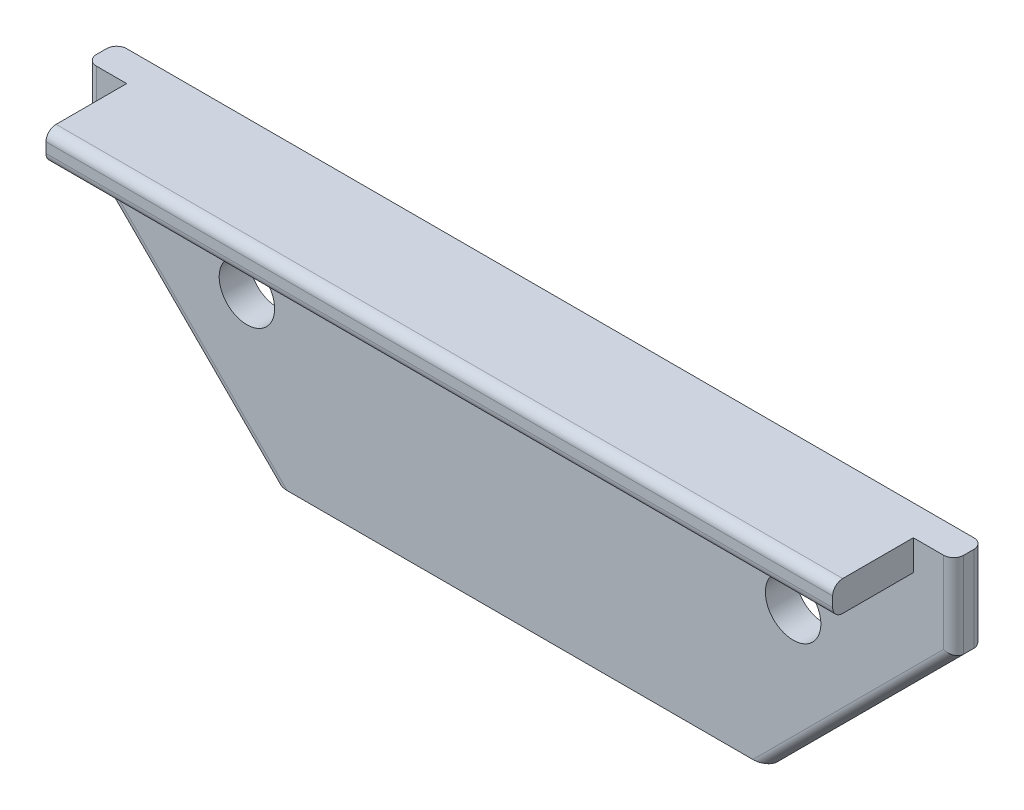
ISO-10303-21;
HEADER;
FILE_DESCRIPTION(('STEP AP214'),'2;1');
FILE_NAME('part.step','',(''),(''),'','','');
FILE_SCHEMA(('AUTOMOTIVE_DESIGN { 1 0 10303 214 1 1 1 1 }'));
ENDSEC;
DATA;
#1=APPLICATION_CONTEXT('core data for automotive mechanical design processes');
#2=APPLICATION_PROTOCOL_DEFINITION('international standard','automotive_design',2000,#1);
#3=PRODUCT_CONTEXT('',#1,'mechanical');
#4=PRODUCT('Part','Part','',(#3));
#5=PRODUCT_RELATED_PRODUCT_CATEGORY('part','',(#4));
#6=PRODUCT_DEFINITION_FORMATION('','',#4);
#7=PRODUCT_DEFINITION_CONTEXT('part definition',#1,'design');
#8=PRODUCT_DEFINITION('design','',#6,#7);
#9=PRODUCT_DEFINITION_SHAPE('','',#8);
#10=(LENGTH_UNIT() NAMED_UNIT(*) SI_UNIT(.MILLI.,.METRE.));
#11=(NAMED_UNIT(*) PLANE_ANGLE_UNIT() SI_UNIT($,.RADIAN.));
#12=(NAMED_UNIT(*) SI_UNIT($,.STERADIAN.) SOLID_ANGLE_UNIT());
#13=UNCERTAINTY_MEASURE_WITH_UNIT(LENGTH_MEASURE(1.E-05),#10,'distance_accuracy_value','');
#14=(GEOMETRIC_REPRESENTATION_CONTEXT(3) GLOBAL_UNCERTAINTY_ASSIGNED_CONTEXT((#13)) GLOBAL_UNIT_ASSIGNED_CONTEXT((#10,
#11,#12)) REPRESENTATION_CONTEXT('',''));
#15=CARTESIAN_POINT('',(0.,0.,0.));
#16=DIRECTION('',(0.,0.,1.));
#17=DIRECTION('',(1.,0.,0.));
#18=AXIS2_PLACEMENT_3D('',#15,#16,#17);
#19=CARTESIAN_POINT('',(0.,0.,-7.9375));
#20=DIRECTION('',(0.,0.,-1.));
#21=DIRECTION('',(-1.,0.,0.));
#22=AXIS2_PLACEMENT_3D('',#19,#20,#21);
#23=PLANE('',#22);
#24=CARTESIAN_POINT('',(85.9789999123034,4.76249999514226,-7.9375));
#25=DIRECTION('',(0.,0.,-1.));
#26=DIRECTION('',(-1.,0.,0.));
#27=AXIS2_PLACEMENT_3D('',#24,#25,#26);
#28=CIRCLE('',#27,8.73124999109411);
#29=CARTESIAN_POINT('',(77.2477499212093,4.76249999514226,-7.9375));
#30=VERTEX_POINT('',#29);
#31=EDGE_CURVE('E227',#30,#30,#28,.T.);
#32=ORIENTED_EDGE('',*,*,#31,.T.);
#33=EDGE_LOOP('',(#32));
#34=FACE_BOUND('',#33,.T.);
#35=CARTESIAN_POINT('',(-85.9789999123005,4.76249999514226,-7.9375));
#36=DIRECTION('',(0.,0.,-1.));
#37=DIRECTION('',(-1.,0.,0.));
#38=AXIS2_PLACEMENT_3D('',#35,#36,#37);
#39=CIRCLE('',#38,8.73124999109411);
#40=CARTESIAN_POINT('',(-94.7102499033946,4.76249999514226,-7.9375));
#41=VERTEX_POINT('',#40);
#42=EDGE_CURVE('E192',#41,#41,#39,.T.);
#43=ORIENTED_EDGE('',*,*,#42,.T.);
#44=EDGE_LOOP('',(#43));
#45=FACE_BOUND('',#44,.T.);
#46=DIRECTION('',(-1.,0.,0.));
#47=VECTOR('',#46,1.);
#48=CARTESIAN_POINT('',(136.524999860745,42.8624999562803,-7.9375));
#49=LINE('',#48,#47);
#50=CARTESIAN_POINT('',(-123.824999873699,42.8624999562803,-7.9375));
#51=VERTEX_POINT('',#50);
#52=CARTESIAN_POINT('',(-133.349999860745,42.8624999562803,-7.9375));
#53=VERTEX_POINT('',#52);
#54=EDGE_CURVE('E183',#51,#53,#49,.T.);
#55=ORIENTED_EDGE('',*,*,#54,.T.);
#56=DIRECTION('',(0.,-1.,0.));
#57=VECTOR('',#56,1.);
#58=CARTESIAN_POINT('',(-133.349999860745,15.8749999838082,-7.9375));
#59=LINE('',#58,#57);
#60=CARTESIAN_POINT('',(-133.349999860745,17.1901280443428,-7.9375));
#61=VERTEX_POINT('',#60);
#62=EDGE_CURVE('E270',#53,#61,#59,.T.);
#63=ORIENTED_EDGE('',*,*,#62,.T.);
#64=DIRECTION('',(0.707106781186556,-0.707106781186539,0.));
#65=VECTOR('',#64,1.);
#66=CARTESIAN_POINT('',(-75.5424358903875,-40.617435926013,-7.9375));
#67=LINE('',#66,#65);
#68=CARTESIAN_POINT('',(-73.2973718601201,-42.8624999562803,-7.9375));
#69=VERTEX_POINT('',#68);
#70=EDGE_CURVE('E268',#61,#69,#67,.T.);
#71=ORIENTED_EDGE('',*,*,#70,.T.);
#72=DIRECTION('',(1.,0.,0.));
#73=VECTOR('',#72,1.);
#74=CARTESIAN_POINT('',(-77.7874999206547,-42.8624999562803,-7.9375));
#75=LINE('',#74,#73);
#76=CARTESIAN_POINT('',(73.2973718601231,-42.8624999562803,-7.9375));
#77=VERTEX_POINT('',#76);
#78=EDGE_CURVE('E182',#69,#77,#75,.T.);
#79=ORIENTED_EDGE('',*,*,#78,.T.);
#80=DIRECTION('',(0.707106781186539,0.707106781186556,0.));
#81=VECTOR('',#80,1.);
#82=CARTESIAN_POINT('',(134.279935830477,18.1200640140755,-7.9375));
#83=LINE('',#82,#81);
#84=CARTESIAN_POINT('',(133.349999860745,17.1901280443428,-7.9375));
#85=VERTEX_POINT('',#84);
#86=EDGE_CURVE('E266',#77,#85,#83,.T.);
#87=ORIENTED_EDGE('',*,*,#86,.T.);
#88=DIRECTION('',(0.,1.,0.));
#89=VECTOR('',#88,1.);
#90=CARTESIAN_POINT('',(133.349999860745,42.8624999562803,-7.9375));
#91=LINE('',#90,#89);
#92=CARTESIAN_POINT('',(133.349999860745,42.8624999562803,-7.9375));
#93=VERTEX_POINT('',#92);
#94=EDGE_CURVE('E181',#85,#93,#91,.T.);
#95=ORIENTED_EDGE('',*,*,#94,.T.);
#96=CARTESIAN_POINT('',(123.824999873699,42.8624999562803,-7.9375));
#97=VERTEX_POINT('',#96);
#98=EDGE_CURVE('E163',#93,#97,#49,.T.);
#99=ORIENTED_EDGE('',*,*,#98,.T.);
#100=DIRECTION('',(0.,1.,0.));
#101=VECTOR('',#100,1.);
#102=CARTESIAN_POINT('',(123.824999873699,42.8624999562803,-7.9375));
#103=LINE('',#102,#101);
#104=CARTESIAN_POINT('',(123.824999873699,33.3374999659958,-7.9375));
#105=VERTEX_POINT('',#104);
#106=EDGE_CURVE('E177',#105,#97,#103,.T.);
#107=ORIENTED_EDGE('',*,*,#106,.F.);
#108=DIRECTION('',(1.,0.,0.));
#109=VECTOR('',#108,1.);
#110=CARTESIAN_POINT('',(123.824999873699,33.3374999659958,-7.9375));
#111=LINE('',#110,#109);
#112=CARTESIAN_POINT('',(-123.824999873699,33.3374999659958,-7.9375));
#113=VERTEX_POINT('',#112);
#114=EDGE_CURVE('E187',#113,#105,#111,.T.);
#115=ORIENTED_EDGE('',*,*,#114,.F.);
#116=DIRECTION('',(0.,-1.,0.));
#117=VECTOR('',#116,1.);
#118=CARTESIAN_POINT('',(-123.824999873699,33.3374999659958,-7.9375));
#119=LINE('',#118,#117);
#120=EDGE_CURVE('E186',#51,#113,#119,.T.);
#121=ORIENTED_EDGE('',*,*,#120,.F.);
#122=EDGE_LOOP('',(#55,#63,#71,#79,#87,#95,#99,#107,#115,#121));
#123=FACE_BOUND('',#122,.T.);
#124=ADVANCED_FACE('F34',(#34,#45,#123),#23,.F.);
#125=CARTESIAN_POINT('',(77.7874999206576,-42.8624999562803,-17.4625));
#126=DIRECTION('',(0.707106781186556,-0.707106781186539,0.));
#127=DIRECTION('',(0.707106781186539,0.707106781186556,0.));
#128=AXIS2_PLACEMENT_3D('',#125,#126,#127);
#129=PLANE('',#128);
#130=DIRECTION('',(0.,0.,1.));
#131=VECTOR('',#130,1.);
#132=CARTESIAN_POINT('',(77.7874999206576,-42.8624999562803,-17.4625));
#133=LINE('',#132,#131);
#134=CARTESIAN_POINT('',(77.7874999206576,-42.8624999562803,-14.2875));
#135=VERTEX_POINT('',#134);
#136=CARTESIAN_POINT('',(77.7874999206576,-42.8624999562803,-11.1125));
#137=VERTEX_POINT('',#136);
#138=EDGE_CURVE('E209',#135,#137,#133,.T.);
#139=ORIENTED_EDGE('',*,*,#138,.F.);
#140=DIRECTION('',(0.707106781186539,0.707106781186556,0.));
#141=VECTOR('',#140,1.);
#142=CARTESIAN_POINT('',(77.7874999206576,-42.8624999562803,-14.2875));
#143=LINE('',#142,#141);
#144=CARTESIAN_POINT('',(136.524999860745,15.8749999838083,-14.2875));
#145=VERTEX_POINT('',#144);
#146=EDGE_CURVE('E280',#135,#145,#143,.T.);
#147=ORIENTED_EDGE('',*,*,#146,.T.);
#148=DIRECTION('',(0.,0.,1.));
#149=VECTOR('',#148,1.);
#150=CARTESIAN_POINT('',(136.524999860745,15.8749999838083,-17.4625));
#151=LINE('',#150,#149);
#152=CARTESIAN_POINT('',(136.524999860745,15.8749999838083,-11.1125));
#153=VERTEX_POINT('',#152);
#154=EDGE_CURVE('E205',#145,#153,#151,.T.);
#155=ORIENTED_EDGE('',*,*,#154,.T.);
#156=DIRECTION('',(0.707106781186539,0.707106781186556,0.));
#157=VECTOR('',#156,1.);
#158=CARTESIAN_POINT('',(77.7874999206576,-42.8624999562803,-11.1125));
#159=LINE('',#158,#157);
#160=EDGE_CURVE('E278',#153,#137,#159,.F.);
#161=ORIENTED_EDGE('',*,*,#160,.T.);
#162=EDGE_LOOP('',(#139,#147,#155,#161));
#163=FACE_BOUND('',#162,.T.);
#164=ADVANCED_FACE('F391',(#163),#129,.T.);
#165=CARTESIAN_POINT('',(-77.7874999206547,-42.8624999562803,-17.4625));
#166=DIRECTION('',(0.,-1.,0.));
#167=DIRECTION('',(0.,0.,-1.));
#168=AXIS2_PLACEMENT_3D('',#165,#166,#167);
#169=PLANE('',#168);
#170=DIRECTION('',(0.,0.,1.));
#171=VECTOR('',#170,1.);
#172=CARTESIAN_POINT('',(-77.7874999206547,-42.8624999562803,-17.4625));
#173=LINE('',#172,#171);
#174=CARTESIAN_POINT('',(-77.7874999206547,-42.8624999562803,-14.2875));
#175=VERTEX_POINT('',#174);
#176=CARTESIAN_POINT('',(-77.7874999206547,-42.8624999562803,-11.1125));
#177=VERTEX_POINT('',#176);
#178=EDGE_CURVE('E213',#175,#177,#173,.T.);
#179=ORIENTED_EDGE('',*,*,#178,.F.);
#180=CARTESIAN_POINT('',(-73.2973718601201,-42.8624999562803,-14.2875));
#181=DIRECTION('',(0.,-1.,0.));
#182=DIRECTION('',(1.,0.,0.));
#183=AXIS2_PLACEMENT_3D('',#180,#181,#182);
#184=ELLIPSE('',#183,4.49012806053463,3.175);
#185=CARTESIAN_POINT('',(-73.2973718601201,-42.8624999562803,-17.4625));
#186=VERTEX_POINT('',#185);
#187=EDGE_CURVE('E242',#175,#186,#184,.T.);
#188=ORIENTED_EDGE('',*,*,#187,.T.);
#189=DIRECTION('',(1.,0.,0.));
#190=VECTOR('',#189,1.);
#191=CARTESIAN_POINT('',(-77.7874999206547,-42.8624999562803,-17.4625));
#192=LINE('',#191,#190);
#193=CARTESIAN_POINT('',(73.2973718601231,-42.8624999562803,-17.4625));
#194=VERTEX_POINT('',#193);
#195=EDGE_CURVE('E203',#186,#194,#192,.T.);
#196=ORIENTED_EDGE('',*,*,#195,.T.);
#197=CARTESIAN_POINT('',(73.2973718601231,-42.8624999562803,-14.2875));
#198=DIRECTION('',(0.,-1.,0.));
#199=DIRECTION('',(1.,0.,0.));
#200=AXIS2_PLACEMENT_3D('',#197,#198,#199);
#201=ELLIPSE('',#200,4.49012806053452,3.175);
#202=EDGE_CURVE('E238',#194,#135,#201,.T.);
#203=ORIENTED_EDGE('',*,*,#202,.T.);
#204=ORIENTED_EDGE('',*,*,#138,.T.);
#205=CARTESIAN_POINT('',(73.2973718601231,-42.8624999562803,-11.1125));
#206=DIRECTION('',(0.,-1.,0.));
#207=DIRECTION('',(-1.,0.,0.));
#208=AXIS2_PLACEMENT_3D('',#205,#206,#207);
#209=ELLIPSE('',#208,4.49012806053452,3.175);
#210=EDGE_CURVE('E236',#137,#77,#209,.T.);
#211=ORIENTED_EDGE('',*,*,#210,.T.);
#212=ORIENTED_EDGE('',*,*,#78,.F.);
#213=CARTESIAN_POINT('',(-73.2973718601201,-42.8624999562803,-11.1125));
#214=DIRECTION('',(0.,-1.,0.));
#215=DIRECTION('',(-1.,0.,0.));
#216=AXIS2_PLACEMENT_3D('',#213,#214,#215);
#217=ELLIPSE('',#216,4.49012806053463,3.175);
#218=EDGE_CURVE('E240',#69,#177,#217,.T.);
#219=ORIENTED_EDGE('',*,*,#218,.T.);
#220=EDGE_LOOP('',(#179,#188,#196,#203,#204,#211,#212,#219));
#221=FACE_BOUND('',#220,.T.);
#222=ADVANCED_FACE('F318',(#221),#169,.T.);
#223=CARTESIAN_POINT('',(-136.524999860745,15.8749999838082,-17.4625));
#224=DIRECTION('',(-0.707106781186539,-0.707106781186556,0.));
#225=DIRECTION('',(0.707106781186556,-0.707106781186539,0.));
#226=AXIS2_PLACEMENT_3D('',#223,#224,#225);
#227=PLANE('',#226);
#228=DIRECTION('',(0.,0.,1.));
#229=VECTOR('',#228,1.);
#230=CARTESIAN_POINT('',(-136.524999860745,15.8749999838082,-17.4625));
#231=LINE('',#230,#229);
#232=CARTESIAN_POINT('',(-136.524999860745,15.8749999838082,-14.2875));
#233=VERTEX_POINT('',#232);
#234=CARTESIAN_POINT('',(-136.524999860745,15.8749999838082,-11.1125));
#235=VERTEX_POINT('',#234);
#236=EDGE_CURVE('E216',#233,#235,#231,.T.);
#237=ORIENTED_EDGE('',*,*,#236,.F.);
#238=DIRECTION('',(0.707106781186556,-0.707106781186539,0.));
#239=VECTOR('',#238,1.);
#240=CARTESIAN_POINT('',(-136.524999860745,15.8749999838082,-14.2875));
#241=LINE('',#240,#239);
#242=EDGE_CURVE('E233',#233,#175,#241,.T.);
#243=ORIENTED_EDGE('',*,*,#242,.T.);
#244=ORIENTED_EDGE('',*,*,#178,.T.);
#245=DIRECTION('',(0.707106781186556,-0.707106781186539,0.));
#246=VECTOR('',#245,1.);
#247=CARTESIAN_POINT('',(-136.524999860745,15.8749999838082,-11.1125));
#248=LINE('',#247,#246);
#249=EDGE_CURVE('E212',#177,#235,#248,.F.);
#250=ORIENTED_EDGE('',*,*,#249,.T.);
#251=EDGE_LOOP('',(#237,#243,#244,#250));
#252=FACE_BOUND('',#251,.T.);
#253=ADVANCED_FACE('F325',(#252),#227,.T.);
#254=CARTESIAN_POINT('',(-136.524999860745,42.8624999562803,-17.4625));
#255=DIRECTION('',(-1.,0.,0.));
#256=DIRECTION('',(0.,0.,1.));
#257=AXIS2_PLACEMENT_3D('',#254,#255,#256);
#258=PLANE('',#257);
#259=DIRECTION('',(0.,0.,1.));
#260=VECTOR('',#259,1.);
#261=CARTESIAN_POINT('',(-136.524999860745,42.8624999562803,-17.4625));
#262=LINE('',#261,#260);
#263=CARTESIAN_POINT('',(-136.524999860745,42.8624999562803,-14.2875));
#264=VERTEX_POINT('',#263);
#265=CARTESIAN_POINT('',(-136.524999860745,42.8624999562803,-11.1125));
#266=VERTEX_POINT('',#265);
#267=EDGE_CURVE('E219',#264,#266,#262,.T.);
#268=ORIENTED_EDGE('',*,*,#267,.F.);
#269=DIRECTION('',(0.,-1.,0.));
#270=VECTOR('',#269,1.);
#271=CARTESIAN_POINT('',(-136.524999860745,42.8624999562803,-14.2875));
#272=LINE('',#271,#270);
#273=EDGE_CURVE('E254',#264,#233,#272,.T.);
#274=ORIENTED_EDGE('',*,*,#273,.T.);
#275=ORIENTED_EDGE('',*,*,#236,.T.);
#276=DIRECTION('',(0.,-1.,0.));
#277=VECTOR('',#276,1.);
#278=CARTESIAN_POINT('',(-136.524999860745,42.8624999562803,-11.1125));
#279=LINE('',#278,#277);
#280=EDGE_CURVE('E252',#235,#266,#279,.F.);
#281=ORIENTED_EDGE('',*,*,#280,.T.);
#282=EDGE_LOOP('',(#268,#274,#275,#281));
#283=FACE_BOUND('',#282,.T.);
#284=ADVANCED_FACE('F330',(#283),#258,.T.);
#285=CARTESIAN_POINT('',(136.524999860745,42.8624999562803,-17.4625));
#286=DIRECTION('',(0.,1.,0.));
#287=DIRECTION('',(0.,0.,1.));
#288=AXIS2_PLACEMENT_3D('',#285,#286,#287);
#289=PLANE('',#288);
#290=DIRECTION('',(-1.,0.,0.));
#291=VECTOR('',#290,1.);
#292=CARTESIAN_POINT('',(136.524999860745,42.8624999562803,-17.4625));
#293=LINE('',#292,#291);
#294=CARTESIAN_POINT('',(133.349999860745,42.8624999562803,-17.4625));
#295=VERTEX_POINT('',#294);
#296=CARTESIAN_POINT('',(-133.349999860745,42.8624999562803,-17.4625));
#297=VERTEX_POINT('',#296);
#298=EDGE_CURVE('E201',#295,#297,#293,.T.);
#299=ORIENTED_EDGE('',*,*,#298,.T.);
#300=CARTESIAN_POINT('',(-133.349999860745,42.8624999562803,-14.2875));
#301=DIRECTION('',(0.,1.,0.));
#302=DIRECTION('',(0.,0.,1.));
#303=AXIS2_PLACEMENT_3D('',#300,#301,#302);
#304=CIRCLE('',#303,3.175);
#305=EDGE_CURVE('E263',#297,#264,#304,.T.);
#306=ORIENTED_EDGE('',*,*,#305,.T.);
#307=ORIENTED_EDGE('',*,*,#267,.T.);
#308=CARTESIAN_POINT('',(-133.349999860745,42.8624999562803,-11.1125));
#309=DIRECTION('',(0.,1.,0.));
#310=DIRECTION('',(0.,0.,1.));
#311=AXIS2_PLACEMENT_3D('',#308,#309,#310);
#312=CIRCLE('',#311,3.175);
#313=EDGE_CURVE('E261',#266,#53,#312,.T.);
#314=ORIENTED_EDGE('',*,*,#313,.T.);
#315=ORIENTED_EDGE('',*,*,#54,.F.);
#316=DIRECTION('',(0.,0.,-1.));
#317=VECTOR('',#316,1.);
#318=CARTESIAN_POINT('',(-123.824999873699,42.8624999562803,17.4625));
#319=LINE('',#318,#317);
#320=CARTESIAN_POINT('',(-123.824999873699,42.8624999562803,14.2875));
#321=VERTEX_POINT('',#320);
#322=EDGE_CURVE('E171',#321,#51,#319,.T.);
#323=ORIENTED_EDGE('',*,*,#322,.F.);
#324=DIRECTION('',(-1.,0.,0.));
#325=VECTOR('',#324,1.);
#326=CARTESIAN_POINT('',(123.824999873699,42.8624999562803,14.2875));
#327=LINE('',#326,#325);
#328=CARTESIAN_POINT('',(123.824999873699,42.8624999562803,14.2875));
#329=VERTEX_POINT('',#328);
#330=EDGE_CURVE('E167',#321,#329,#327,.F.);
#331=ORIENTED_EDGE('',*,*,#330,.T.);
#332=DIRECTION('',(0.,0.,-1.));
#333=VECTOR('',#332,1.);
#334=CARTESIAN_POINT('',(123.824999873699,42.8624999562803,17.4625));
#335=LINE('',#334,#333);
#336=EDGE_CURVE('E159',#329,#97,#335,.T.);
#337=ORIENTED_EDGE('',*,*,#336,.T.);
#338=ORIENTED_EDGE('',*,*,#98,.F.);
#339=CARTESIAN_POINT('',(133.349999860745,42.8624999562803,-11.1125));
#340=DIRECTION('',(0.,1.,0.));
#341=DIRECTION('',(0.,0.,1.));
#342=AXIS2_PLACEMENT_3D('',#339,#340,#341);
#343=CIRCLE('',#342,3.175);
#344=CARTESIAN_POINT('',(136.524999860745,42.8624999562803,-11.1125));
#345=VERTEX_POINT('',#344);
#346=EDGE_CURVE('E256',#93,#345,#343,.T.);
#347=ORIENTED_EDGE('',*,*,#346,.T.);
#348=DIRECTION('',(0.,0.,1.));
#349=VECTOR('',#348,1.);
#350=CARTESIAN_POINT('',(136.524999860745,42.8624999562803,-17.4625));
#351=LINE('',#350,#349);
#352=CARTESIAN_POINT('',(136.524999860745,42.8624999562803,-14.2875));
#353=VERTEX_POINT('',#352);
#354=EDGE_CURVE('E222',#353,#345,#351,.T.);
#355=ORIENTED_EDGE('',*,*,#354,.F.);
#356=CARTESIAN_POINT('',(133.349999860745,42.8624999562803,-14.2875));
#357=DIRECTION('',(0.,1.,0.));
#358=DIRECTION('',(0.,0.,1.));
#359=AXIS2_PLACEMENT_3D('',#356,#357,#358);
#360=CIRCLE('',#359,3.175);
#361=EDGE_CURVE('E259',#353,#295,#360,.T.);
#362=ORIENTED_EDGE('',*,*,#361,.T.);
#363=EDGE_LOOP('',(#299,#306,#307,#314,#315,#323,#331,#337,#338,#347,#355,#362));
#364=FACE_BOUND('',#363,.T.);
#365=ADVANCED_FACE('F162',(#364),#289,.T.);
#366=CARTESIAN_POINT('',(136.524999860745,15.8749999838083,-17.4625));
#367=DIRECTION('',(1.,0.,0.));
#368=DIRECTION('',(0.,0.,-1.));
#369=AXIS2_PLACEMENT_3D('',#366,#367,#368);
#370=PLANE('',#369);
#371=ORIENTED_EDGE('',*,*,#154,.F.);
#372=DIRECTION('',(0.,1.,0.));
#373=VECTOR('',#372,1.);
#374=CARTESIAN_POINT('',(136.524999860745,15.8749999838083,-14.2875));
#375=LINE('',#374,#373);
#376=EDGE_CURVE('E275',#145,#353,#375,.T.);
#377=ORIENTED_EDGE('',*,*,#376,.T.);
#378=ORIENTED_EDGE('',*,*,#354,.T.);
#379=DIRECTION('',(0.,1.,0.));
#380=VECTOR('',#379,1.);
#381=CARTESIAN_POINT('',(136.524999860745,15.8749999838083,-11.1125));
#382=LINE('',#381,#380);
#383=EDGE_CURVE('E273',#345,#153,#382,.F.);
#384=ORIENTED_EDGE('',*,*,#383,.T.);
#385=EDGE_LOOP('',(#371,#377,#378,#384));
#386=FACE_BOUND('',#385,.T.);
#387=ADVANCED_FACE('F366',(#386),#370,.T.);
#388=CARTESIAN_POINT('',(0.,0.,-17.4625));
#389=DIRECTION('',(0.,0.,-1.));
#390=DIRECTION('',(-1.,0.,0.));
#391=AXIS2_PLACEMENT_3D('',#388,#389,#390);
#392=PLANE('',#391);
#393=CARTESIAN_POINT('',(85.9789999123034,4.76249999514226,-17.4625));
#394=DIRECTION('',(0.,0.,-1.));
#395=DIRECTION('',(-1.,0.,0.));
#396=AXIS2_PLACEMENT_3D('',#393,#394,#395);
#397=CIRCLE('',#396,8.73124999109411);
#398=CARTESIAN_POINT('',(77.2477499212093,4.76249999514226,-17.4625));
#399=VERTEX_POINT('',#398);
#400=EDGE_CURVE('E231',#399,#399,#397,.T.);
#401=ORIENTED_EDGE('',*,*,#400,.F.);
#402=EDGE_LOOP('',(#401));
#403=FACE_BOUND('',#402,.T.);
#404=CARTESIAN_POINT('',(-85.9789999123005,4.76249999514226,-17.4625));
#405=DIRECTION('',(0.,0.,-1.));
#406=DIRECTION('',(-1.,0.,0.));
#407=AXIS2_PLACEMENT_3D('',#404,#405,#406);
#408=CIRCLE('',#407,8.73124999109411);
#409=CARTESIAN_POINT('',(-94.7102499033946,4.76249999514226,-17.4625));
#410=VERTEX_POINT('',#409);
#411=EDGE_CURVE('E230',#410,#410,#408,.T.);
#412=ORIENTED_EDGE('',*,*,#411,.F.);
#413=EDGE_LOOP('',(#412));
#414=FACE_BOUND('',#413,.T.);
#415=ORIENTED_EDGE('',*,*,#195,.F.);
#416=DIRECTION('',(0.707106781186556,-0.707106781186539,0.));
#417=VECTOR('',#416,1.);
#418=CARTESIAN_POINT('',(-58.0799359081993,-58.0799359082007,-17.4625));
#419=LINE('',#418,#417);
#420=CARTESIAN_POINT('',(-133.349999860745,17.1901280443428,-17.4625));
#421=VERTEX_POINT('',#420);
#422=EDGE_CURVE('E250',#186,#421,#419,.F.);
#423=ORIENTED_EDGE('',*,*,#422,.T.);
#424=DIRECTION('',(0.,-1.,0.));
#425=VECTOR('',#424,1.);
#426=CARTESIAN_POINT('',(-133.349999860745,0.,-17.4625));
#427=LINE('',#426,#425);
#428=EDGE_CURVE('E248',#421,#297,#427,.F.);
#429=ORIENTED_EDGE('',*,*,#428,.T.);
#430=ORIENTED_EDGE('',*,*,#298,.F.);
#431=DIRECTION('',(0.,1.,0.));
#432=VECTOR('',#431,1.);
#433=CARTESIAN_POINT('',(133.349999860745,0.,-17.4625));
#434=LINE('',#433,#432);
#435=CARTESIAN_POINT('',(133.349999860745,17.1901280443428,-17.4625));
#436=VERTEX_POINT('',#435);
#437=EDGE_CURVE('E246',#295,#436,#434,.F.);
#438=ORIENTED_EDGE('',*,*,#437,.T.);
#439=DIRECTION('',(0.707106781186539,0.707106781186556,0.));
#440=VECTOR('',#439,1.);
#441=CARTESIAN_POINT('',(58.0799359082026,-58.0799359082012,-17.4625));
#442=LINE('',#441,#440);
#443=EDGE_CURVE('E244',#436,#194,#442,.F.);
#444=ORIENTED_EDGE('',*,*,#443,.T.);
#445=EDGE_LOOP('',(#415,#423,#429,#430,#438,#444));
#446=FACE_BOUND('',#445,.T.);
#447=ADVANCED_FACE('F362',(#403,#414,#446),#392,.T.);
#448=CARTESIAN_POINT('',(123.824999873699,33.3374999659958,17.4625));
#449=DIRECTION('',(0.,1.,0.));
#450=DIRECTION('',(0.,0.,1.));
#451=AXIS2_PLACEMENT_3D('',#448,#449,#450);
#452=PLANE('',#451);
#453=DIRECTION('',(0.,0.,-1.));
#454=VECTOR('',#453,1.);
#455=CARTESIAN_POINT('',(123.824999873699,33.3374999659958,17.4625));
#456=LINE('',#455,#454);
#457=CARTESIAN_POINT('',(123.824999873699,33.3374999659958,14.2875));
#458=VERTEX_POINT('',#457);
#459=EDGE_CURVE('E170',#458,#105,#456,.T.);
#460=ORIENTED_EDGE('',*,*,#459,.F.);
#461=DIRECTION('',(1.,0.,0.));
#462=VECTOR('',#461,1.);
#463=CARTESIAN_POINT('',(123.824999873699,33.3374999659958,14.2875));
#464=LINE('',#463,#462);
#465=CARTESIAN_POINT('',(-123.824999873699,33.3374999659958,14.2875));
#466=VERTEX_POINT('',#465);
#467=EDGE_CURVE('E11',#458,#466,#464,.F.);
#468=ORIENTED_EDGE('',*,*,#467,.T.);
#469=DIRECTION('',(0.,0.,-1.));
#470=VECTOR('',#469,1.);
#471=CARTESIAN_POINT('',(-123.824999873699,33.3374999659958,17.4625));
#472=LINE('',#471,#470);
#473=EDGE_CURVE('E196',#466,#113,#472,.T.);
#474=ORIENTED_EDGE('',*,*,#473,.T.);
#475=ORIENTED_EDGE('',*,*,#114,.T.);
#476=EDGE_LOOP('',(#460,#468,#474,#475));
#477=FACE_BOUND('',#476,.T.);
#478=ADVANCED_FACE('F365',(#477),#452,.F.);
#479=CARTESIAN_POINT('',(123.824999873699,42.8624999562803,17.4625));
#480=DIRECTION('',(-1.,0.,0.));
#481=DIRECTION('',(0.,0.,1.));
#482=AXIS2_PLACEMENT_3D('',#479,#480,#481);
#483=PLANE('',#482);
#484=ORIENTED_EDGE('',*,*,#336,.F.);
#485=CARTESIAN_POINT('',(123.824999873699,39.6874999562803,14.2875));
#486=DIRECTION('',(-1.,0.,0.));
#487=DIRECTION('',(0.,0.,1.));
#488=AXIS2_PLACEMENT_3D('',#485,#486,#487);
#489=CIRCLE('',#488,3.175);
#490=CARTESIAN_POINT('',(123.824999873699,39.6874999562803,17.4625));
#491=VERTEX_POINT('',#490);
#492=EDGE_CURVE('E43',#329,#491,#489,.F.);
#493=ORIENTED_EDGE('',*,*,#492,.T.);
#494=DIRECTION('',(0.,1.,0.));
#495=VECTOR('',#494,1.);
#496=CARTESIAN_POINT('',(123.824999873699,42.8624999562803,17.4625));
#497=LINE('',#496,#495);
#498=CARTESIAN_POINT('',(123.824999873699,36.5124999659958,17.4625));
#499=VERTEX_POINT('',#498);
#500=EDGE_CURVE('E190',#499,#491,#497,.T.);
#501=ORIENTED_EDGE('',*,*,#500,.F.);
#502=CARTESIAN_POINT('',(123.824999873699,36.5124999659958,14.2875));
#503=DIRECTION('',(-1.,0.,0.));
#504=DIRECTION('',(0.,0.,1.));
#505=AXIS2_PLACEMENT_3D('',#502,#503,#504);
#506=CIRCLE('',#505,3.175);
#507=EDGE_CURVE('E51',#499,#458,#506,.F.);
#508=ORIENTED_EDGE('',*,*,#507,.T.);
#509=ORIENTED_EDGE('',*,*,#459,.T.);
#510=ORIENTED_EDGE('',*,*,#106,.T.);
#511=EDGE_LOOP('',(#484,#493,#501,#508,#509,#510));
#512=FACE_BOUND('',#511,.T.);
#513=ADVANCED_FACE('F185',(#512),#483,.F.);
#514=CARTESIAN_POINT('',(-123.824999873699,33.3374999659958,17.4625));
#515=DIRECTION('',(1.,0.,0.));
#516=DIRECTION('',(0.,0.,-1.));
#517=AXIS2_PLACEMENT_3D('',#514,#515,#516);
#518=PLANE('',#517);
#519=DIRECTION('',(0.,-1.,0.));
#520=VECTOR('',#519,1.);
#521=CARTESIAN_POINT('',(-123.824999873699,33.3374999659958,17.4625));
#522=LINE('',#521,#520);
#523=CARTESIAN_POINT('',(-123.824999873699,39.6874999562803,17.4625));
#524=VERTEX_POINT('',#523);
#525=CARTESIAN_POINT('',(-123.824999873699,36.5124999659958,17.4625));
#526=VERTEX_POINT('',#525);
#527=EDGE_CURVE('E198',#524,#526,#522,.T.);
#528=ORIENTED_EDGE('',*,*,#527,.F.);
#529=CARTESIAN_POINT('',(-123.824999873699,39.6874999562803,14.2875));
#530=DIRECTION('',(1.,0.,0.));
#531=DIRECTION('',(0.,0.,-1.));
#532=AXIS2_PLACEMENT_3D('',#529,#530,#531);
#533=CIRCLE('',#532,3.175);
#534=EDGE_CURVE('E290',#524,#321,#533,.F.);
#535=ORIENTED_EDGE('',*,*,#534,.T.);
#536=ORIENTED_EDGE('',*,*,#322,.T.);
#537=ORIENTED_EDGE('',*,*,#120,.T.);
#538=ORIENTED_EDGE('',*,*,#473,.F.);
#539=CARTESIAN_POINT('',(-123.824999873699,36.5124999659958,14.2875));
#540=DIRECTION('',(1.,0.,0.));
#541=DIRECTION('',(0.,0.,-1.));
#542=AXIS2_PLACEMENT_3D('',#539,#540,#541);
#543=CIRCLE('',#542,3.175);
#544=EDGE_CURVE('E288',#466,#526,#543,.F.);
#545=ORIENTED_EDGE('',*,*,#544,.T.);
#546=EDGE_LOOP('',(#528,#535,#536,#537,#538,#545));
#547=FACE_BOUND('',#546,.T.);
#548=ADVANCED_FACE('F340',(#547),#518,.F.);
#549=CARTESIAN_POINT('',(0.,0.,17.4625));
#550=DIRECTION('',(0.,0.,-1.));
#551=DIRECTION('',(-1.,0.,0.));
#552=AXIS2_PLACEMENT_3D('',#549,#550,#551);
#553=PLANE('',#552);
#554=ORIENTED_EDGE('',*,*,#500,.T.);
#555=DIRECTION('',(-1.,0.,0.));
#556=VECTOR('',#555,1.);
#557=CARTESIAN_POINT('',(-123.824999873699,39.6874999562803,17.4625));
#558=LINE('',#557,#556);
#559=EDGE_CURVE('E285',#491,#524,#558,.T.);
#560=ORIENTED_EDGE('',*,*,#559,.T.);
#561=ORIENTED_EDGE('',*,*,#527,.T.);
#562=DIRECTION('',(1.,0.,0.));
#563=VECTOR('',#562,1.);
#564=CARTESIAN_POINT('',(0.,36.5124999659958,17.4625));
#565=LINE('',#564,#563);
#566=EDGE_CURVE('E282',#526,#499,#565,.T.);
#567=ORIENTED_EDGE('',*,*,#566,.T.);
#568=EDGE_LOOP('',(#554,#560,#561,#567));
#569=FACE_BOUND('',#568,.T.);
#570=ADVANCED_FACE('F347',(#569),#553,.F.);
#571=CARTESIAN_POINT('',(-85.9789999123005,4.76249999514226,-17.4625));
#572=DIRECTION('',(0.,0.,-1.));
#573=DIRECTION('',(-1.,0.,0.));
#574=AXIS2_PLACEMENT_3D('',#571,#572,#573);
#575=CYLINDRICAL_SURFACE('',#574,8.73124999109411);
#576=ORIENTED_EDGE('',*,*,#411,.T.);
#577=EDGE_LOOP('',(#576));
#578=FACE_BOUND('',#577,.T.);
#579=ORIENTED_EDGE('',*,*,#42,.F.);
#580=EDGE_LOOP('',(#579));
#581=FACE_BOUND('',#580,.T.);
#582=ADVANCED_FACE('F483',(#578,#581),#575,.F.);
#583=CARTESIAN_POINT('',(85.9789999123034,4.76249999514226,-17.4625));
#584=DIRECTION('',(0.,0.,-1.));
#585=DIRECTION('',(-1.,0.,0.));
#586=AXIS2_PLACEMENT_3D('',#583,#584,#585);
#587=CYLINDRICAL_SURFACE('',#586,8.73124999109411);
#588=ORIENTED_EDGE('',*,*,#400,.T.);
#589=EDGE_LOOP('',(#588));
#590=FACE_BOUND('',#589,.T.);
#591=ORIENTED_EDGE('',*,*,#31,.F.);
#592=EDGE_LOOP('',(#591));
#593=FACE_BOUND('',#592,.T.);
#594=ADVANCED_FACE('F359',(#590,#593),#587,.F.);
#595=CARTESIAN_POINT('',(-133.349999860745,42.8624999562803,-14.2875));
#596=DIRECTION('',(0.,-1.,0.));
#597=DIRECTION('',(0.,0.,-1.));
#598=AXIS2_PLACEMENT_3D('',#595,#596,#597);
#599=CYLINDRICAL_SURFACE('',#598,3.175);
#600=ORIENTED_EDGE('',*,*,#305,.F.);
#601=ORIENTED_EDGE('',*,*,#428,.F.);
#602=CARTESIAN_POINT('',(-133.349999860745,17.1901280443428,-14.2875));
#603=DIRECTION('',(0.382683432365096,-0.923879532511284,0.));
#604=DIRECTION('',(-0.923879532511284,-0.382683432365096,0.));
#605=AXIS2_PLACEMENT_3D('',#602,#603,#604);
#606=ELLIPSE('',#605,3.43659523592836,3.175);
#607=EDGE_CURVE('E294',#233,#421,#606,.T.);
#608=ORIENTED_EDGE('',*,*,#607,.F.);
#609=ORIENTED_EDGE('',*,*,#273,.F.);
#610=EDGE_LOOP('',(#600,#601,#608,#609));
#611=FACE_BOUND('',#610,.T.);
#612=ADVANCED_FACE('F380',(#611),#599,.T.);
#613=CARTESIAN_POINT('',(-134.279935830477,18.1200640140756,-14.2875));
#614=DIRECTION('',(0.707106781186556,-0.707106781186539,0.));
#615=DIRECTION('',(0.707106781186539,0.707106781186556,0.));
#616=AXIS2_PLACEMENT_3D('',#613,#614,#615);
#617=CYLINDRICAL_SURFACE('',#616,3.175);
#618=ORIENTED_EDGE('',*,*,#607,.T.);
#619=ORIENTED_EDGE('',*,*,#422,.F.);
#620=ORIENTED_EDGE('',*,*,#187,.F.);
#621=ORIENTED_EDGE('',*,*,#242,.F.);
#622=EDGE_LOOP('',(#618,#619,#620,#621));
#623=FACE_BOUND('',#622,.T.);
#624=ADVANCED_FACE('F376',(#623),#617,.T.);
#625=CARTESIAN_POINT('',(-58.0799359081993,-58.0799359082007,-11.1125));
#626=DIRECTION('',(-0.707106781186556,0.707106781186539,0.));
#627=DIRECTION('',(-0.707106781186539,-0.707106781186556,0.));
#628=AXIS2_PLACEMENT_3D('',#625,#626,#627);
#629=CYLINDRICAL_SURFACE('',#628,3.175);
#630=ORIENTED_EDGE('',*,*,#218,.F.);
#631=ORIENTED_EDGE('',*,*,#70,.F.);
#632=CARTESIAN_POINT('',(-133.349999860745,17.1901280443428,-11.1125));
#633=DIRECTION('',(-0.382683432365096,0.923879532511284,0.));
#634=DIRECTION('',(-0.923879532511284,-0.382683432365096,0.));
#635=AXIS2_PLACEMENT_3D('',#632,#633,#634);
#636=ELLIPSE('',#635,3.43659523592836,3.175);
#637=EDGE_CURVE('E297',#235,#61,#636,.T.);
#638=ORIENTED_EDGE('',*,*,#637,.F.);
#639=ORIENTED_EDGE('',*,*,#249,.F.);
#640=EDGE_LOOP('',(#630,#631,#638,#639));
#641=FACE_BOUND('',#640,.T.);
#642=ADVANCED_FACE('F321',(#641),#629,.T.);
#643=CARTESIAN_POINT('',(-133.349999860745,0.,-11.1125));
#644=DIRECTION('',(0.,1.,0.));
#645=DIRECTION('',(0.,0.,1.));
#646=AXIS2_PLACEMENT_3D('',#643,#644,#645);
#647=CYLINDRICAL_SURFACE('',#646,3.175);
#648=ORIENTED_EDGE('',*,*,#313,.F.);
#649=ORIENTED_EDGE('',*,*,#280,.F.);
#650=ORIENTED_EDGE('',*,*,#637,.T.);
#651=ORIENTED_EDGE('',*,*,#62,.F.);
#652=EDGE_LOOP('',(#648,#649,#650,#651));
#653=FACE_BOUND('',#652,.T.);
#654=ADVANCED_FACE('F334',(#653),#647,.T.);
#655=CARTESIAN_POINT('',(75.5424358903903,-40.6174359260131,-14.2875));
#656=DIRECTION('',(0.707106781186539,0.707106781186556,0.));
#657=DIRECTION('',(-0.707106781186556,0.707106781186539,0.));
#658=AXIS2_PLACEMENT_3D('',#655,#656,#657);
#659=CYLINDRICAL_SURFACE('',#658,3.175);
#660=ORIENTED_EDGE('',*,*,#202,.F.);
#661=ORIENTED_EDGE('',*,*,#443,.F.);
#662=CARTESIAN_POINT('',(133.349999860745,17.1901280443428,-14.2875));
#663=DIRECTION('',(0.382683432365084,0.923879532511289,0.));
#664=DIRECTION('',(0.923879532511289,-0.382683432365084,0.));
#665=AXIS2_PLACEMENT_3D('',#662,#663,#664);
#666=ELLIPSE('',#665,3.43659523592834,3.175);
#667=EDGE_CURVE('E298',#145,#436,#666,.T.);
#668=ORIENTED_EDGE('',*,*,#667,.F.);
#669=ORIENTED_EDGE('',*,*,#146,.F.);
#670=EDGE_LOOP('',(#660,#661,#668,#669));
#671=FACE_BOUND('',#670,.T.);
#672=ADVANCED_FACE('F389',(#671),#659,.T.);
#673=CARTESIAN_POINT('',(133.349999860745,15.8749999838083,-14.2875));
#674=DIRECTION('',(0.,1.,0.));
#675=DIRECTION('',(0.,0.,1.));
#676=AXIS2_PLACEMENT_3D('',#673,#674,#675);
#677=CYLINDRICAL_SURFACE('',#676,3.175);
#678=ORIENTED_EDGE('',*,*,#667,.T.);
#679=ORIENTED_EDGE('',*,*,#437,.F.);
#680=ORIENTED_EDGE('',*,*,#361,.F.);
#681=ORIENTED_EDGE('',*,*,#376,.F.);
#682=EDGE_LOOP('',(#678,#679,#680,#681));
#683=FACE_BOUND('',#682,.T.);
#684=ADVANCED_FACE('F383',(#683),#677,.T.);
#685=CARTESIAN_POINT('',(0.,39.6874999562803,14.2875));
#686=DIRECTION('',(1.,0.,0.));
#687=DIRECTION('',(0.,0.,-1.));
#688=AXIS2_PLACEMENT_3D('',#685,#686,#687);
#689=CYLINDRICAL_SURFACE('',#688,3.175);
#690=ORIENTED_EDGE('',*,*,#492,.F.);
#691=ORIENTED_EDGE('',*,*,#330,.F.);
#692=ORIENTED_EDGE('',*,*,#534,.F.);
#693=ORIENTED_EDGE('',*,*,#559,.F.);
#694=EDGE_LOOP('',(#690,#691,#692,#693));
#695=FACE_BOUND('',#694,.T.);
#696=ADVANCED_FACE('F343',(#695),#689,.T.);
#697=CARTESIAN_POINT('',(133.349999860745,0.,-11.1125));
#698=DIRECTION('',(0.,-1.,0.));
#699=DIRECTION('',(0.,0.,-1.));
#700=AXIS2_PLACEMENT_3D('',#697,#698,#699);
#701=CYLINDRICAL_SURFACE('',#700,3.175);
#702=ORIENTED_EDGE('',*,*,#346,.F.);
#703=ORIENTED_EDGE('',*,*,#94,.F.);
#704=CARTESIAN_POINT('',(133.349999860745,17.1901280443428,-11.1125));
#705=DIRECTION('',(-0.382683432365084,-0.923879532511289,0.));
#706=DIRECTION('',(0.923879532511289,-0.382683432365084,0.));
#707=AXIS2_PLACEMENT_3D('',#704,#705,#706);
#708=ELLIPSE('',#707,3.43659523592834,3.175);
#709=EDGE_CURVE('E38',#153,#85,#708,.T.);
#710=ORIENTED_EDGE('',*,*,#709,.F.);
#711=ORIENTED_EDGE('',*,*,#383,.F.);
#712=EDGE_LOOP('',(#702,#703,#710,#711));
#713=FACE_BOUND('',#712,.T.);
#714=ADVANCED_FACE('F312',(#713),#701,.T.);
#715=CARTESIAN_POINT('',(58.0799359082026,-58.0799359082012,-11.1125));
#716=DIRECTION('',(-0.707106781186539,-0.707106781186556,0.));
#717=DIRECTION('',(0.707106781186556,-0.707106781186539,0.));
#718=AXIS2_PLACEMENT_3D('',#715,#716,#717);
#719=CYLINDRICAL_SURFACE('',#718,3.175);
#720=ORIENTED_EDGE('',*,*,#210,.F.);
#721=ORIENTED_EDGE('',*,*,#160,.F.);
#722=ORIENTED_EDGE('',*,*,#709,.T.);
#723=ORIENTED_EDGE('',*,*,#86,.F.);
#724=EDGE_LOOP('',(#720,#721,#722,#723));
#725=FACE_BOUND('',#724,.T.);
#726=ADVANCED_FACE('F309',(#725),#719,.T.);
#727=CARTESIAN_POINT('',(0.,36.5124999659958,14.2875));
#728=DIRECTION('',(1.,0.,0.));
#729=DIRECTION('',(0.,0.,-1.));
#730=AXIS2_PLACEMENT_3D('',#727,#728,#729);
#731=CYLINDRICAL_SURFACE('',#730,3.175);
#732=ORIENTED_EDGE('',*,*,#544,.F.);
#733=ORIENTED_EDGE('',*,*,#467,.F.);
#734=ORIENTED_EDGE('',*,*,#507,.F.);
#735=ORIENTED_EDGE('',*,*,#566,.F.);
#736=EDGE_LOOP('',(#732,#733,#734,#735));
#737=FACE_BOUND('',#736,.T.);
#738=ADVANCED_FACE('F36',(#737),#731,.T.);
#739=CLOSED_SHELL('',(#124,#164,#222,#253,#284,#365,#387,#447,#478,#513,#548,#570,#582,#594,
#612,#624,#642,#654,#672,#684,#696,#714,#726,#738));
#740=MANIFOLD_SOLID_BREP('B2',#739);
#741=ADVANCED_BREP_SHAPE_REPRESENTATION('',(#18,#740),#14);
#742=SHAPE_DEFINITION_REPRESENTATION(#9,#741);
ENDSEC;
END-ISO-10303-21;
